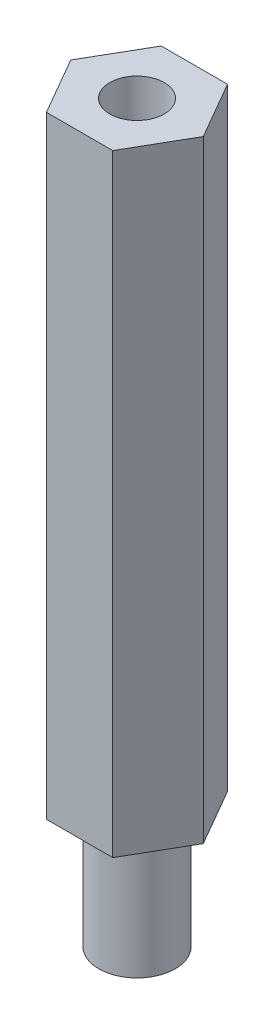
ISO-10303-21;
HEADER;
FILE_DESCRIPTION(('STEP AP214'),'2;1');
FILE_NAME('part.step','',(''),(''),'','','');
FILE_SCHEMA(('AUTOMOTIVE_DESIGN { 1 0 10303 214 1 1 1 1 }'));
ENDSEC;
DATA;
#1=APPLICATION_CONTEXT('core data for automotive mechanical design processes');
#2=APPLICATION_PROTOCOL_DEFINITION('international standard','automotive_design',2000,#1);
#3=PRODUCT_CONTEXT('',#1,'mechanical');
#4=PRODUCT('Part','Part','',(#3));
#5=PRODUCT_RELATED_PRODUCT_CATEGORY('part','',(#4));
#6=PRODUCT_DEFINITION_FORMATION('','',#4);
#7=PRODUCT_DEFINITION_CONTEXT('part definition',#1,'design');
#8=PRODUCT_DEFINITION('design','',#6,#7);
#9=PRODUCT_DEFINITION_SHAPE('','',#8);
#10=(LENGTH_UNIT() NAMED_UNIT(*) SI_UNIT(.MILLI.,.METRE.));
#11=(NAMED_UNIT(*) PLANE_ANGLE_UNIT() SI_UNIT($,.RADIAN.));
#12=(NAMED_UNIT(*) SI_UNIT($,.STERADIAN.) SOLID_ANGLE_UNIT());
#13=UNCERTAINTY_MEASURE_WITH_UNIT(LENGTH_MEASURE(1.E-05),#10,'distance_accuracy_value','');
#14=(GEOMETRIC_REPRESENTATION_CONTEXT(3) GLOBAL_UNCERTAINTY_ASSIGNED_CONTEXT((#13)) GLOBAL_UNIT_ASSIGNED_CONTEXT((#10,
#11,#12)) REPRESENTATION_CONTEXT('',''));
#15=CARTESIAN_POINT('',(0.,0.,0.));
#16=DIRECTION('',(0.,0.,1.));
#17=DIRECTION('',(1.,0.,0.));
#18=AXIS2_PLACEMENT_3D('',#15,#16,#17);
#19=CARTESIAN_POINT('',(-1.3748153285078,0.,-2.38125));
#20=DIRECTION('',(0.,-1.,0.));
#21=DIRECTION('',(0.,0.,-1.));
#22=AXIS2_PLACEMENT_3D('',#19,#20,#21);
#23=PLANE('',#22);
#24=DIRECTION('',(-0.5,0.,0.866025403784439));
#25=VECTOR('',#24,1.);
#26=CARTESIAN_POINT('',(-2.74963065701559,0.,0.));
#27=LINE('',#26,#25);
#28=CARTESIAN_POINT('',(-1.3748153285078,0.,-2.38125));
#29=VERTEX_POINT('',#28);
#30=CARTESIAN_POINT('',(-2.74963065701559,0.,0.));
#31=VERTEX_POINT('',#30);
#32=EDGE_CURVE('E123',#29,#31,#27,.T.);
#33=ORIENTED_EDGE('',*,*,#32,.F.);
#34=DIRECTION('',(-1.,0.,0.));
#35=VECTOR('',#34,1.);
#36=CARTESIAN_POINT('',(-1.3748153285078,0.,-2.38125));
#37=LINE('',#36,#35);
#38=CARTESIAN_POINT('',(1.3748153285078,0.,-2.38125));
#39=VERTEX_POINT('',#38);
#40=EDGE_CURVE('E83',#39,#29,#37,.T.);
#41=ORIENTED_EDGE('',*,*,#40,.F.);
#42=DIRECTION('',(-0.5,0.,-0.866025403784439));
#43=VECTOR('',#42,1.);
#44=CARTESIAN_POINT('',(1.3748153285078,0.,-2.38125));
#45=LINE('',#44,#43);
#46=CARTESIAN_POINT('',(2.74963065701559,0.,0.));
#47=VERTEX_POINT('',#46);
#48=EDGE_CURVE('E77',#47,#39,#45,.T.);
#49=ORIENTED_EDGE('',*,*,#48,.F.);
#50=DIRECTION('',(0.5,0.,-0.866025403784439));
#51=VECTOR('',#50,1.);
#52=CARTESIAN_POINT('',(2.74963065701559,0.,0.));
#53=LINE('',#52,#51);
#54=CARTESIAN_POINT('',(1.37481532850779,0.,2.38125));
#55=VERTEX_POINT('',#54);
#56=EDGE_CURVE('E113',#55,#47,#53,.T.);
#57=ORIENTED_EDGE('',*,*,#56,.F.);
#58=DIRECTION('',(1.,0.,0.));
#59=VECTOR('',#58,1.);
#60=CARTESIAN_POINT('',(1.37481532850779,0.,2.38125));
#61=LINE('',#60,#59);
#62=CARTESIAN_POINT('',(-1.37481532850779,0.,2.38125));
#63=VERTEX_POINT('',#62);
#64=EDGE_CURVE('E129',#63,#55,#61,.T.);
#65=ORIENTED_EDGE('',*,*,#64,.F.);
#66=DIRECTION('',(0.5,0.,0.866025403784439));
#67=VECTOR('',#66,1.);
#68=CARTESIAN_POINT('',(-1.37481532850779,0.,2.38125));
#69=LINE('',#68,#67);
#70=EDGE_CURVE('E126',#31,#63,#69,.T.);
#71=ORIENTED_EDGE('',*,*,#70,.F.);
#72=EDGE_LOOP('',(#33,#41,#49,#57,#65,#71));
#73=FACE_BOUND('',#72,.T.);
#74=CARTESIAN_POINT('',(0.,0.,0.));
#75=DIRECTION('',(0.,-1.,0.));
#76=DIRECTION('',(0.,0.,-1.));
#77=AXIS2_PLACEMENT_3D('',#74,#75,#76);
#78=CIRCLE('',#77,1.5875);
#79=CARTESIAN_POINT('',(0.,0.,-1.5875));
#80=VERTEX_POINT('',#79);
#81=EDGE_CURVE('E185',#80,#80,#78,.T.);
#82=ORIENTED_EDGE('',*,*,#81,.F.);
#83=EDGE_LOOP('',(#82));
#84=FACE_BOUND('',#83,.T.);
#85=ADVANCED_FACE('F36',(#73,#84),#23,.T.);
#86=CARTESIAN_POINT('',(-2.74963065701559,25.4,0.));
#87=DIRECTION('',(0.866025403784439,0.,0.5));
#88=DIRECTION('',(0.5,0.,-0.866025403784439));
#89=AXIS2_PLACEMENT_3D('',#86,#87,#88);
#90=PLANE('',#89);
#91=ORIENTED_EDGE('',*,*,#32,.T.);
#92=DIRECTION('',(0.,-1.,0.));
#93=VECTOR('',#92,1.);
#94=CARTESIAN_POINT('',(-2.74963065701559,25.4,0.));
#95=LINE('',#94,#93);
#96=CARTESIAN_POINT('',(-2.74963065701559,25.4,0.));
#97=VERTEX_POINT('',#96);
#98=EDGE_CURVE('E11',#97,#31,#95,.T.);
#99=ORIENTED_EDGE('',*,*,#98,.F.);
#100=DIRECTION('',(-0.5,0.,0.866025403784439));
#101=VECTOR('',#100,1.);
#102=CARTESIAN_POINT('',(-2.74963065701559,25.4,0.));
#103=LINE('',#102,#101);
#104=CARTESIAN_POINT('',(-1.3748153285078,25.4,-2.38125));
#105=VERTEX_POINT('',#104);
#106=EDGE_CURVE('E134',#105,#97,#103,.T.);
#107=ORIENTED_EDGE('',*,*,#106,.F.);
#108=DIRECTION('',(0.,-1.,0.));
#109=VECTOR('',#108,1.);
#110=CARTESIAN_POINT('',(-1.3748153285078,25.4,-2.38125));
#111=LINE('',#110,#109);
#112=EDGE_CURVE('E119',#105,#29,#111,.T.);
#113=ORIENTED_EDGE('',*,*,#112,.T.);
#114=EDGE_LOOP('',(#91,#99,#107,#113));
#115=FACE_BOUND('',#114,.T.);
#116=ADVANCED_FACE('F38',(#115),#90,.F.);
#117=CARTESIAN_POINT('',(-1.37481532850779,25.4,2.38125));
#118=DIRECTION('',(0.866025403784438,0.,-0.5));
#119=DIRECTION('',(-0.5,0.,-0.866025403784439));
#120=AXIS2_PLACEMENT_3D('',#117,#118,#119);
#121=PLANE('',#120);
#122=ORIENTED_EDGE('',*,*,#70,.T.);
#123=DIRECTION('',(0.,-1.,0.));
#124=VECTOR('',#123,1.);
#125=CARTESIAN_POINT('',(-1.37481532850779,25.4,2.38125));
#126=LINE('',#125,#124);
#127=CARTESIAN_POINT('',(-1.37481532850779,25.4,2.38125));
#128=VERTEX_POINT('',#127);
#129=EDGE_CURVE('E45',#128,#63,#126,.T.);
#130=ORIENTED_EDGE('',*,*,#129,.F.);
#131=DIRECTION('',(0.5,0.,0.866025403784439));
#132=VECTOR('',#131,1.);
#133=CARTESIAN_POINT('',(-1.37481532850779,25.4,2.38125));
#134=LINE('',#133,#132);
#135=EDGE_CURVE('E91',#97,#128,#134,.T.);
#136=ORIENTED_EDGE('',*,*,#135,.F.);
#137=ORIENTED_EDGE('',*,*,#98,.T.);
#138=EDGE_LOOP('',(#122,#130,#136,#137));
#139=FACE_BOUND('',#138,.T.);
#140=ADVANCED_FACE('F163',(#139),#121,.F.);
#141=CARTESIAN_POINT('',(1.37481532850779,25.4,2.38125));
#142=DIRECTION('',(0.,0.,-1.));
#143=DIRECTION('',(-1.,0.,0.));
#144=AXIS2_PLACEMENT_3D('',#141,#142,#143);
#145=PLANE('',#144);
#146=ORIENTED_EDGE('',*,*,#64,.T.);
#147=DIRECTION('',(0.,-1.,0.));
#148=VECTOR('',#147,1.);
#149=CARTESIAN_POINT('',(1.37481532850779,25.4,2.38125));
#150=LINE('',#149,#148);
#151=CARTESIAN_POINT('',(1.37481532850779,25.4,2.38125));
#152=VERTEX_POINT('',#151);
#153=EDGE_CURVE('E114',#152,#55,#150,.T.);
#154=ORIENTED_EDGE('',*,*,#153,.F.);
#155=DIRECTION('',(1.,0.,0.));
#156=VECTOR('',#155,1.);
#157=CARTESIAN_POINT('',(1.37481532850779,25.4,2.38125));
#158=LINE('',#157,#156);
#159=EDGE_CURVE('E105',#128,#152,#158,.T.);
#160=ORIENTED_EDGE('',*,*,#159,.F.);
#161=ORIENTED_EDGE('',*,*,#129,.T.);
#162=EDGE_LOOP('',(#146,#154,#160,#161));
#163=FACE_BOUND('',#162,.T.);
#164=ADVANCED_FACE('F140',(#163),#145,.F.);
#165=CARTESIAN_POINT('',(2.74963065701559,25.4,0.));
#166=DIRECTION('',(-0.866025403784438,0.,-0.5));
#167=DIRECTION('',(-0.5,0.,0.866025403784439));
#168=AXIS2_PLACEMENT_3D('',#165,#166,#167);
#169=PLANE('',#168);
#170=ORIENTED_EDGE('',*,*,#56,.T.);
#171=DIRECTION('',(0.,-1.,0.));
#172=VECTOR('',#171,1.);
#173=CARTESIAN_POINT('',(2.74963065701559,25.4,0.));
#174=LINE('',#173,#172);
#175=CARTESIAN_POINT('',(2.74963065701559,25.4,0.));
#176=VERTEX_POINT('',#175);
#177=EDGE_CURVE('E110',#176,#47,#174,.T.);
#178=ORIENTED_EDGE('',*,*,#177,.F.);
#179=DIRECTION('',(0.5,0.,-0.866025403784439));
#180=VECTOR('',#179,1.);
#181=CARTESIAN_POINT('',(2.74963065701559,25.4,0.));
#182=LINE('',#181,#180);
#183=EDGE_CURVE('E99',#152,#176,#182,.T.);
#184=ORIENTED_EDGE('',*,*,#183,.F.);
#185=ORIENTED_EDGE('',*,*,#153,.T.);
#186=EDGE_LOOP('',(#170,#178,#184,#185));
#187=FACE_BOUND('',#186,.T.);
#188=ADVANCED_FACE('F111',(#187),#169,.F.);
#189=CARTESIAN_POINT('',(1.3748153285078,25.4,-2.38125));
#190=DIRECTION('',(-0.866025403784439,0.,0.5));
#191=DIRECTION('',(0.5,0.,0.866025403784439));
#192=AXIS2_PLACEMENT_3D('',#189,#190,#191);
#193=PLANE('',#192);
#194=ORIENTED_EDGE('',*,*,#48,.T.);
#195=DIRECTION('',(0.,-1.,0.));
#196=VECTOR('',#195,1.);
#197=CARTESIAN_POINT('',(1.3748153285078,25.4,-2.38125));
#198=LINE('',#197,#196);
#199=CARTESIAN_POINT('',(1.3748153285078,25.4,-2.38125));
#200=VERTEX_POINT('',#199);
#201=EDGE_CURVE('E115',#200,#39,#198,.T.);
#202=ORIENTED_EDGE('',*,*,#201,.F.);
#203=DIRECTION('',(-0.5,0.,-0.866025403784439));
#204=VECTOR('',#203,1.);
#205=CARTESIAN_POINT('',(1.3748153285078,25.4,-2.38125));
#206=LINE('',#205,#204);
#207=EDGE_CURVE('E103',#176,#200,#206,.T.);
#208=ORIENTED_EDGE('',*,*,#207,.F.);
#209=ORIENTED_EDGE('',*,*,#177,.T.);
#210=EDGE_LOOP('',(#194,#202,#208,#209));
#211=FACE_BOUND('',#210,.T.);
#212=ADVANCED_FACE('F117',(#211),#193,.F.);
#213=CARTESIAN_POINT('',(-1.3748153285078,25.4,-2.38125));
#214=DIRECTION('',(0.,0.,1.));
#215=DIRECTION('',(1.,0.,0.));
#216=AXIS2_PLACEMENT_3D('',#213,#214,#215);
#217=PLANE('',#216);
#218=ORIENTED_EDGE('',*,*,#40,.T.);
#219=ORIENTED_EDGE('',*,*,#112,.F.);
#220=DIRECTION('',(-1.,0.,0.));
#221=VECTOR('',#220,1.);
#222=CARTESIAN_POINT('',(-1.3748153285078,25.4,-2.38125));
#223=LINE('',#222,#221);
#224=EDGE_CURVE('E53',#200,#105,#223,.T.);
#225=ORIENTED_EDGE('',*,*,#224,.F.);
#226=ORIENTED_EDGE('',*,*,#201,.T.);
#227=EDGE_LOOP('',(#218,#219,#225,#226));
#228=FACE_BOUND('',#227,.T.);
#229=ADVANCED_FACE('F147',(#228),#217,.F.);
#230=CARTESIAN_POINT('',(-1.3748153285078,25.4,-2.38125));
#231=DIRECTION('',(0.,-1.,0.));
#232=DIRECTION('',(0.,0.,-1.));
#233=AXIS2_PLACEMENT_3D('',#230,#231,#232);
#234=PLANE('',#233);
#235=CARTESIAN_POINT('',(0.,25.4,0.));
#236=DIRECTION('',(0.,1.,0.));
#237=DIRECTION('',(0.,0.,1.));
#238=AXIS2_PLACEMENT_3D('',#235,#236,#237);
#239=CIRCLE('',#238,1.1303);
#240=CARTESIAN_POINT('',(0.,25.4,1.1303));
#241=VERTEX_POINT('',#240);
#242=EDGE_CURVE('E127',#241,#241,#239,.T.);
#243=ORIENTED_EDGE('',*,*,#242,.F.);
#244=EDGE_LOOP('',(#243));
#245=FACE_BOUND('',#244,.T.);
#246=ORIENTED_EDGE('',*,*,#106,.T.);
#247=ORIENTED_EDGE('',*,*,#135,.T.);
#248=ORIENTED_EDGE('',*,*,#159,.T.);
#249=ORIENTED_EDGE('',*,*,#183,.T.);
#250=ORIENTED_EDGE('',*,*,#207,.T.);
#251=ORIENTED_EDGE('',*,*,#224,.T.);
#252=EDGE_LOOP('',(#246,#247,#248,#249,#250,#251));
#253=FACE_BOUND('',#252,.T.);
#254=ADVANCED_FACE('F101',(#245,#253),#234,.F.);
#255=CARTESIAN_POINT('',(0.,25.4,0.));
#256=DIRECTION('',(0.,1.,0.));
#257=DIRECTION('',(0.,0.,1.));
#258=AXIS2_PLACEMENT_3D('',#255,#256,#257);
#259=CYLINDRICAL_SURFACE('',#258,1.1303);
#260=CARTESIAN_POINT('',(0.,17.78,0.));
#261=DIRECTION('',(0.,1.,0.));
#262=DIRECTION('',(0.,0.,1.));
#263=AXIS2_PLACEMENT_3D('',#260,#261,#262);
#264=CIRCLE('',#263,1.1303);
#265=CARTESIAN_POINT('',(0.,17.78,1.1303));
#266=VERTEX_POINT('',#265);
#267=EDGE_CURVE('E184',#266,#266,#264,.T.);
#268=ORIENTED_EDGE('',*,*,#267,.F.);
#269=EDGE_LOOP('',(#268));
#270=FACE_BOUND('',#269,.T.);
#271=ORIENTED_EDGE('',*,*,#242,.T.);
#272=EDGE_LOOP('',(#271));
#273=FACE_BOUND('',#272,.T.);
#274=ADVANCED_FACE('F154',(#270,#273),#259,.F.);
#275=CARTESIAN_POINT('',(0.,17.78,0.));
#276=DIRECTION('',(0.,1.,0.));
#277=DIRECTION('',(0.,0.,1.));
#278=AXIS2_PLACEMENT_3D('',#275,#276,#277);
#279=CONICAL_SURFACE('',#278,1.1303,1.02974425867665);
#280=CARTESIAN_POINT('',(0.,17.1008472423132,0.));
#281=VERTEX_POINT('',#280);
#282=VERTEX_LOOP('',#281);
#283=FACE_BOUND('',#282,.T.);
#284=ORIENTED_EDGE('',*,*,#267,.T.);
#285=EDGE_LOOP('',(#284));
#286=FACE_BOUND('',#285,.T.);
#287=ADVANCED_FACE('F167',(#283,#286),#279,.F.);
#288=CARTESIAN_POINT('',(0.,-5.08,0.));
#289=DIRECTION('',(0.,1.,0.));
#290=DIRECTION('',(0.,0.,1.));
#291=AXIS2_PLACEMENT_3D('',#288,#289,#290);
#292=CYLINDRICAL_SURFACE('',#291,1.5875);
#293=CARTESIAN_POINT('',(0.,-5.08,0.));
#294=DIRECTION('',(0.,-1.,0.));
#295=DIRECTION('',(0.,0.,-1.));
#296=AXIS2_PLACEMENT_3D('',#293,#294,#295);
#297=CIRCLE('',#296,1.5875);
#298=CARTESIAN_POINT('',(0.,-5.08,-1.5875));
#299=VERTEX_POINT('',#298);
#300=EDGE_CURVE('E183',#299,#299,#297,.T.);
#301=ORIENTED_EDGE('',*,*,#300,.F.);
#302=EDGE_LOOP('',(#301));
#303=FACE_BOUND('',#302,.T.);
#304=ORIENTED_EDGE('',*,*,#81,.T.);
#305=EDGE_LOOP('',(#304));
#306=FACE_BOUND('',#305,.T.);
#307=ADVANCED_FACE('F171',(#303,#306),#292,.T.);
#308=CARTESIAN_POINT('',(0.,-5.08,0.));
#309=DIRECTION('',(0.,-1.,0.));
#310=DIRECTION('',(0.,0.,-1.));
#311=AXIS2_PLACEMENT_3D('',#308,#309,#310);
#312=PLANE('',#311);
#313=ORIENTED_EDGE('',*,*,#300,.T.);
#314=EDGE_LOOP('',(#313));
#315=FACE_BOUND('',#314,.T.);
#316=ADVANCED_FACE('F175',(#315),#312,.T.);
#317=CLOSED_SHELL('',(#85,#116,#140,#164,#188,#212,#229,#254,#274,#287,#307,#316));
#318=MANIFOLD_SOLID_BREP('B2',#317);
#319=ADVANCED_BREP_SHAPE_REPRESENTATION('',(#18,#318),#14);
#320=SHAPE_DEFINITION_REPRESENTATION(#9,#319);
ENDSEC;
END-ISO-10303-21;
